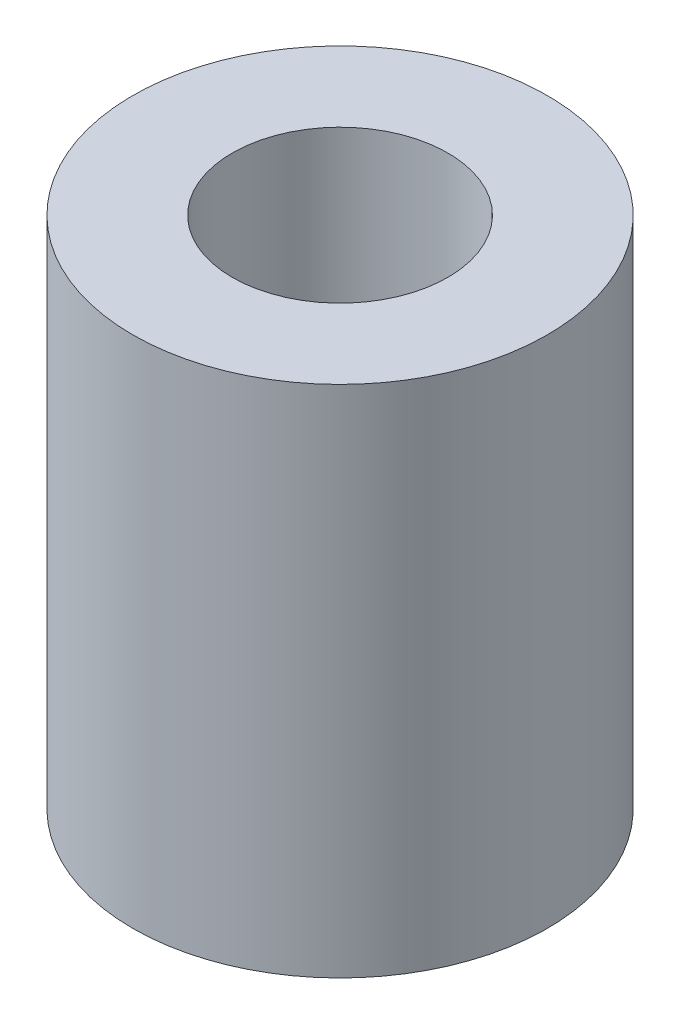
ISO-10303-21;
HEADER;
FILE_DESCRIPTION(('STEP AP214'),'2;1');
FILE_NAME('part.step','',(''),(''),'','','');
FILE_SCHEMA(('AUTOMOTIVE_DESIGN { 1 0 10303 214 1 1 1 1 }'));
ENDSEC;
DATA;
#1=APPLICATION_CONTEXT('core data for automotive mechanical design processes');
#2=APPLICATION_PROTOCOL_DEFINITION('international standard','automotive_design',2000,#1);
#3=PRODUCT_CONTEXT('',#1,'mechanical');
#4=PRODUCT('Part','Part','',(#3));
#5=PRODUCT_RELATED_PRODUCT_CATEGORY('part','',(#4));
#6=PRODUCT_DEFINITION_FORMATION('','',#4);
#7=PRODUCT_DEFINITION_CONTEXT('part definition',#1,'design');
#8=PRODUCT_DEFINITION('design','',#6,#7);
#9=PRODUCT_DEFINITION_SHAPE('','',#8);
#10=(LENGTH_UNIT() NAMED_UNIT(*) SI_UNIT(.MILLI.,.METRE.));
#11=(NAMED_UNIT(*) PLANE_ANGLE_UNIT() SI_UNIT($,.RADIAN.));
#12=(NAMED_UNIT(*) SI_UNIT($,.STERADIAN.) SOLID_ANGLE_UNIT());
#13=UNCERTAINTY_MEASURE_WITH_UNIT(LENGTH_MEASURE(1.E-05),#10,'distance_accuracy_value','');
#14=(GEOMETRIC_REPRESENTATION_CONTEXT(3) GLOBAL_UNCERTAINTY_ASSIGNED_CONTEXT((#13)) GLOBAL_UNIT_ASSIGNED_CONTEXT((#10,
#11,#12)) REPRESENTATION_CONTEXT('',''));
#15=CARTESIAN_POINT('',(0.,0.,0.));
#16=DIRECTION('',(0.,0.,1.));
#17=DIRECTION('',(1.,0.,0.));
#18=AXIS2_PLACEMENT_3D('',#15,#16,#17);
#19=CARTESIAN_POINT('',(0.,31.,0.));
#20=DIRECTION('',(0.,1.,0.));
#21=DIRECTION('',(0.,0.,1.));
#22=AXIS2_PLACEMENT_3D('',#19,#20,#21);
#23=PLANE('',#22);
#24=CARTESIAN_POINT('',(0.,31.,0.));
#25=DIRECTION('',(0.,1.,0.));
#26=DIRECTION('',(0.,0.,1.));
#27=AXIS2_PLACEMENT_3D('',#24,#25,#26);
#28=CIRCLE('',#27,12.5);
#29=CARTESIAN_POINT('',(0.,31.,12.5));
#30=VERTEX_POINT('',#29);
#31=EDGE_CURVE('E10',#30,#30,#28,.T.);
#32=ORIENTED_EDGE('',*,*,#31,.T.);
#33=EDGE_LOOP('',(#32));
#34=FACE_BOUND('',#33,.T.);
#35=CARTESIAN_POINT('',(0.,31.,0.));
#36=DIRECTION('',(0.,1.,0.));
#37=DIRECTION('',(0.,0.,1.));
#38=AXIS2_PLACEMENT_3D('',#35,#36,#37);
#39=CIRCLE('',#38,6.5);
#40=CARTESIAN_POINT('',(0.,31.,6.5));
#41=VERTEX_POINT('',#40);
#42=EDGE_CURVE('E40',#41,#41,#39,.T.);
#43=ORIENTED_EDGE('',*,*,#42,.F.);
#44=EDGE_LOOP('',(#43));
#45=FACE_BOUND('',#44,.T.);
#46=ADVANCED_FACE('F29',(#34,#45),#23,.T.);
#47=CARTESIAN_POINT('',(0.,0.,0.));
#48=DIRECTION('',(0.,1.,0.));
#49=DIRECTION('',(0.,0.,1.));
#50=AXIS2_PLACEMENT_3D('',#47,#48,#49);
#51=PLANE('',#50);
#52=CARTESIAN_POINT('',(0.,0.,0.));
#53=DIRECTION('',(0.,1.,0.));
#54=DIRECTION('',(0.,0.,1.));
#55=AXIS2_PLACEMENT_3D('',#52,#53,#54);
#56=CIRCLE('',#55,12.5);
#57=CARTESIAN_POINT('',(0.,0.,12.5));
#58=VERTEX_POINT('',#57);
#59=EDGE_CURVE('E33',#58,#58,#56,.T.);
#60=ORIENTED_EDGE('',*,*,#59,.F.);
#61=EDGE_LOOP('',(#60));
#62=FACE_BOUND('',#61,.T.);
#63=CARTESIAN_POINT('',(0.,0.,0.));
#64=DIRECTION('',(0.,1.,0.));
#65=DIRECTION('',(0.,0.,1.));
#66=AXIS2_PLACEMENT_3D('',#63,#64,#65);
#67=CIRCLE('',#66,6.5);
#68=CARTESIAN_POINT('',(0.,0.,6.5));
#69=VERTEX_POINT('',#68);
#70=EDGE_CURVE('E42',#69,#69,#67,.T.);
#71=ORIENTED_EDGE('',*,*,#70,.T.);
#72=EDGE_LOOP('',(#71));
#73=FACE_BOUND('',#72,.T.);
#74=ADVANCED_FACE('F52',(#62,#73),#51,.F.);
#75=CARTESIAN_POINT('',(0.,31.,0.));
#76=DIRECTION('',(0.,-1.,0.));
#77=DIRECTION('',(0.,0.,-1.));
#78=AXIS2_PLACEMENT_3D('',#75,#76,#77);
#79=CYLINDRICAL_SURFACE('',#78,12.5);
#80=ORIENTED_EDGE('',*,*,#31,.F.);
#81=EDGE_LOOP('',(#80));
#82=FACE_BOUND('',#81,.T.);
#83=ORIENTED_EDGE('',*,*,#59,.T.);
#84=EDGE_LOOP('',(#83));
#85=FACE_BOUND('',#84,.T.);
#86=ADVANCED_FACE('F31',(#82,#85),#79,.T.);
#87=CARTESIAN_POINT('',(0.,31.,0.));
#88=DIRECTION('',(0.,-1.,0.));
#89=DIRECTION('',(0.,0.,-1.));
#90=AXIS2_PLACEMENT_3D('',#87,#88,#89);
#91=CYLINDRICAL_SURFACE('',#90,6.5);
#92=ORIENTED_EDGE('',*,*,#42,.T.);
#93=EDGE_LOOP('',(#92));
#94=FACE_BOUND('',#93,.T.);
#95=ORIENTED_EDGE('',*,*,#70,.F.);
#96=EDGE_LOOP('',(#95));
#97=FACE_BOUND('',#96,.T.);
#98=ADVANCED_FACE('F48',(#94,#97),#91,.F.);
#99=CLOSED_SHELL('',(#46,#74,#86,#98));
#100=MANIFOLD_SOLID_BREP('B2',#99);
#101=ADVANCED_BREP_SHAPE_REPRESENTATION('',(#18,#100),#14);
#102=SHAPE_DEFINITION_REPRESENTATION(#9,#101);
ENDSEC;
END-ISO-10303-21;
